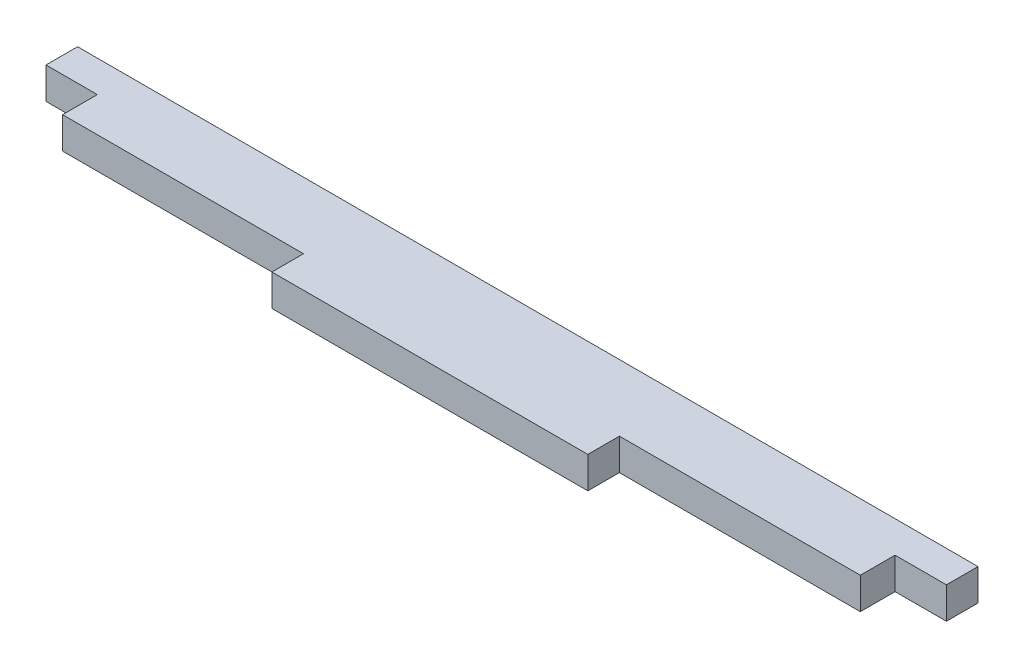
ISO-10303-21;
HEADER;
FILE_DESCRIPTION(('STEP AP214'),'2;1');
FILE_NAME('part.step','',(''),(''),'','','');
FILE_SCHEMA(('AUTOMOTIVE_DESIGN { 1 0 10303 214 1 1 1 1 }'));
ENDSEC;
DATA;
#1=APPLICATION_CONTEXT('core data for automotive mechanical design processes');
#2=APPLICATION_PROTOCOL_DEFINITION('international standard','automotive_design',2000,#1);
#3=PRODUCT_CONTEXT('',#1,'mechanical');
#4=PRODUCT('Part','Part','',(#3));
#5=PRODUCT_RELATED_PRODUCT_CATEGORY('part','',(#4));
#6=PRODUCT_DEFINITION_FORMATION('','',#4);
#7=PRODUCT_DEFINITION_CONTEXT('part definition',#1,'design');
#8=PRODUCT_DEFINITION('design','',#6,#7);
#9=PRODUCT_DEFINITION_SHAPE('','',#8);
#10=(LENGTH_UNIT() NAMED_UNIT(*) SI_UNIT(.MILLI.,.METRE.));
#11=(NAMED_UNIT(*) PLANE_ANGLE_UNIT() SI_UNIT($,.RADIAN.));
#12=(NAMED_UNIT(*) SI_UNIT($,.STERADIAN.) SOLID_ANGLE_UNIT());
#13=UNCERTAINTY_MEASURE_WITH_UNIT(LENGTH_MEASURE(1.E-05),#10,'distance_accuracy_value','');
#14=(GEOMETRIC_REPRESENTATION_CONTEXT(3) GLOBAL_UNCERTAINTY_ASSIGNED_CONTEXT((#13)) GLOBAL_UNIT_ASSIGNED_CONTEXT((#10,
#11,#12)) REPRESENTATION_CONTEXT('',''));
#15=CARTESIAN_POINT('',(0.,0.,0.));
#16=DIRECTION('',(0.,0.,1.));
#17=DIRECTION('',(1.,0.,0.));
#18=AXIS2_PLACEMENT_3D('',#15,#16,#17);
#19=CARTESIAN_POINT('',(-25.25,2.,-4.2));
#20=DIRECTION('',(1.,0.,0.));
#21=DIRECTION('',(0.,0.,-1.));
#22=AXIS2_PLACEMENT_3D('',#19,#20,#21);
#23=PLANE('',#22);
#24=DIRECTION('',(0.,0.,1.));
#25=VECTOR('',#24,1.);
#26=CARTESIAN_POINT('',(-25.25,0.,-4.2));
#27=LINE('',#26,#25);
#28=CARTESIAN_POINT('',(-25.25,0.,-4.2));
#29=VERTEX_POINT('',#28);
#30=CARTESIAN_POINT('',(-25.25,0.,-2.));
#31=VERTEX_POINT('',#30);
#32=EDGE_CURVE('E154',#29,#31,#27,.T.);
#33=ORIENTED_EDGE('',*,*,#32,.T.);
#34=DIRECTION('',(0.,-1.,0.));
#35=VECTOR('',#34,1.);
#36=CARTESIAN_POINT('',(-25.25,2.,-2.));
#37=LINE('',#36,#35);
#38=CARTESIAN_POINT('',(-25.25,2.,-2.));
#39=VERTEX_POINT('',#38);
#40=EDGE_CURVE('E11',#39,#31,#37,.T.);
#41=ORIENTED_EDGE('',*,*,#40,.F.);
#42=DIRECTION('',(0.,0.,1.));
#43=VECTOR('',#42,1.);
#44=CARTESIAN_POINT('',(-25.25,2.,-4.2));
#45=LINE('',#44,#43);
#46=CARTESIAN_POINT('',(-25.25,2.,-4.2));
#47=VERTEX_POINT('',#46);
#48=EDGE_CURVE('E176',#47,#39,#45,.T.);
#49=ORIENTED_EDGE('',*,*,#48,.F.);
#50=DIRECTION('',(0.,-1.,0.));
#51=VECTOR('',#50,1.);
#52=CARTESIAN_POINT('',(-25.25,2.,-4.2));
#53=LINE('',#52,#51);
#54=EDGE_CURVE('E150',#47,#29,#53,.T.);
#55=ORIENTED_EDGE('',*,*,#54,.T.);
#56=EDGE_LOOP('',(#33,#41,#49,#55));
#57=FACE_BOUND('',#56,.T.);
#58=ADVANCED_FACE('F34',(#57),#23,.F.);
#59=CARTESIAN_POINT('',(-25.25,2.,-2.));
#60=DIRECTION('',(0.,0.,-1.));
#61=DIRECTION('',(-1.,0.,0.));
#62=AXIS2_PLACEMENT_3D('',#59,#60,#61);
#63=PLANE('',#62);
#64=DIRECTION('',(1.,0.,0.));
#65=VECTOR('',#64,1.);
#66=CARTESIAN_POINT('',(-25.25,0.,-2.));
#67=LINE('',#66,#65);
#68=CARTESIAN_POINT('',(-10.,0.,-2.));
#69=VERTEX_POINT('',#68);
#70=EDGE_CURVE('E157',#31,#69,#67,.T.);
#71=ORIENTED_EDGE('',*,*,#70,.T.);
#72=DIRECTION('',(0.,-1.,0.));
#73=VECTOR('',#72,1.);
#74=CARTESIAN_POINT('',(-10.,2.,-2.));
#75=LINE('',#74,#73);
#76=CARTESIAN_POINT('',(-10.,2.,-2.));
#77=VERTEX_POINT('',#76);
#78=EDGE_CURVE('E42',#77,#69,#75,.T.);
#79=ORIENTED_EDGE('',*,*,#78,.F.);
#80=DIRECTION('',(1.,0.,0.));
#81=VECTOR('',#80,1.);
#82=CARTESIAN_POINT('',(-25.25,2.,-2.));
#83=LINE('',#82,#81);
#84=EDGE_CURVE('E105',#39,#77,#83,.T.);
#85=ORIENTED_EDGE('',*,*,#84,.F.);
#86=ORIENTED_EDGE('',*,*,#40,.T.);
#87=EDGE_LOOP('',(#71,#79,#85,#86));
#88=FACE_BOUND('',#87,.T.);
#89=ADVANCED_FACE('F254',(#88),#63,.F.);
#90=CARTESIAN_POINT('',(-10.,2.,-2.));
#91=DIRECTION('',(1.,0.,0.));
#92=DIRECTION('',(0.,0.,-1.));
#93=AXIS2_PLACEMENT_3D('',#90,#91,#92);
#94=PLANE('',#93);
#95=DIRECTION('',(0.,0.,1.));
#96=VECTOR('',#95,1.);
#97=CARTESIAN_POINT('',(-10.,0.,-2.));
#98=LINE('',#97,#96);
#99=CARTESIAN_POINT('',(-10.,0.,0.));
#100=VERTEX_POINT('',#99);
#101=EDGE_CURVE('E159',#69,#100,#98,.T.);
#102=ORIENTED_EDGE('',*,*,#101,.T.);
#103=DIRECTION('',(0.,-1.,0.));
#104=VECTOR('',#103,1.);
#105=CARTESIAN_POINT('',(-10.,2.,0.));
#106=LINE('',#105,#104);
#107=CARTESIAN_POINT('',(-10.,2.,0.));
#108=VERTEX_POINT('',#107);
#109=EDGE_CURVE('E195',#108,#100,#106,.T.);
#110=ORIENTED_EDGE('',*,*,#109,.F.);
#111=DIRECTION('',(0.,0.,1.));
#112=VECTOR('',#111,1.);
#113=CARTESIAN_POINT('',(-10.,2.,-2.));
#114=LINE('',#113,#112);
#115=EDGE_CURVE('E203',#77,#108,#114,.T.);
#116=ORIENTED_EDGE('',*,*,#115,.F.);
#117=ORIENTED_EDGE('',*,*,#78,.T.);
#118=EDGE_LOOP('',(#102,#110,#116,#117));
#119=FACE_BOUND('',#118,.T.);
#120=ADVANCED_FACE('F201',(#119),#94,.F.);
#121=CARTESIAN_POINT('',(-10.,2.,0.));
#122=DIRECTION('',(0.,0.,-1.));
#123=DIRECTION('',(-1.,0.,0.));
#124=AXIS2_PLACEMENT_3D('',#121,#122,#123);
#125=PLANE('',#124);
#126=DIRECTION('',(1.,0.,0.));
#127=VECTOR('',#126,1.);
#128=CARTESIAN_POINT('',(-10.,0.,0.));
#129=LINE('',#128,#127);
#130=CARTESIAN_POINT('',(10.,0.,0.));
#131=VERTEX_POINT('',#130);
#132=EDGE_CURVE('E161',#100,#131,#129,.T.);
#133=ORIENTED_EDGE('',*,*,#132,.T.);
#134=DIRECTION('',(0.,-1.,0.));
#135=VECTOR('',#134,1.);
#136=CARTESIAN_POINT('',(10.,2.,0.));
#137=LINE('',#136,#135);
#138=CARTESIAN_POINT('',(10.,2.,0.));
#139=VERTEX_POINT('',#138);
#140=EDGE_CURVE('E192',#139,#131,#137,.T.);
#141=ORIENTED_EDGE('',*,*,#140,.F.);
#142=DIRECTION('',(1.,0.,0.));
#143=VECTOR('',#142,1.);
#144=CARTESIAN_POINT('',(-10.,2.,0.));
#145=LINE('',#144,#143);
#146=EDGE_CURVE('E221',#108,#139,#145,.T.);
#147=ORIENTED_EDGE('',*,*,#146,.F.);
#148=ORIENTED_EDGE('',*,*,#109,.T.);
#149=EDGE_LOOP('',(#133,#141,#147,#148));
#150=FACE_BOUND('',#149,.T.);
#151=ADVANCED_FACE('F212',(#150),#125,.F.);
#152=CARTESIAN_POINT('',(10.,2.,0.));
#153=DIRECTION('',(-1.,0.,0.));
#154=DIRECTION('',(0.,0.,1.));
#155=AXIS2_PLACEMENT_3D('',#152,#153,#154);
#156=PLANE('',#155);
#157=DIRECTION('',(0.,0.,-1.));
#158=VECTOR('',#157,1.);
#159=CARTESIAN_POINT('',(10.,0.,0.));
#160=LINE('',#159,#158);
#161=CARTESIAN_POINT('',(10.,0.,-2.));
#162=VERTEX_POINT('',#161);
#163=EDGE_CURVE('E163',#131,#162,#160,.T.);
#164=ORIENTED_EDGE('',*,*,#163,.T.);
#165=DIRECTION('',(0.,-1.,0.));
#166=VECTOR('',#165,1.);
#167=CARTESIAN_POINT('',(10.,2.,-2.));
#168=LINE('',#167,#166);
#169=CARTESIAN_POINT('',(10.,2.,-2.));
#170=VERTEX_POINT('',#169);
#171=EDGE_CURVE('E189',#170,#162,#168,.T.);
#172=ORIENTED_EDGE('',*,*,#171,.F.);
#173=DIRECTION('',(0.,0.,-1.));
#174=VECTOR('',#173,1.);
#175=CARTESIAN_POINT('',(10.,2.,0.));
#176=LINE('',#175,#174);
#177=EDGE_CURVE('E218',#139,#170,#176,.T.);
#178=ORIENTED_EDGE('',*,*,#177,.F.);
#179=ORIENTED_EDGE('',*,*,#140,.T.);
#180=EDGE_LOOP('',(#164,#172,#178,#179));
#181=FACE_BOUND('',#180,.T.);
#182=ADVANCED_FACE('F216',(#181),#156,.F.);
#183=CARTESIAN_POINT('',(10.,2.,-2.));
#184=DIRECTION('',(0.,0.,-1.));
#185=DIRECTION('',(-1.,0.,0.));
#186=AXIS2_PLACEMENT_3D('',#183,#184,#185);
#187=PLANE('',#186);
#188=DIRECTION('',(1.,0.,0.));
#189=VECTOR('',#188,1.);
#190=CARTESIAN_POINT('',(10.,0.,-2.));
#191=LINE('',#190,#189);
#192=CARTESIAN_POINT('',(25.25,0.,-2.));
#193=VERTEX_POINT('',#192);
#194=EDGE_CURVE('E165',#162,#193,#191,.T.);
#195=ORIENTED_EDGE('',*,*,#194,.T.);
#196=DIRECTION('',(0.,-1.,0.));
#197=VECTOR('',#196,1.);
#198=CARTESIAN_POINT('',(25.25,2.,-2.));
#199=LINE('',#198,#197);
#200=CARTESIAN_POINT('',(25.25,2.,-2.));
#201=VERTEX_POINT('',#200);
#202=EDGE_CURVE('E186',#201,#193,#199,.T.);
#203=ORIENTED_EDGE('',*,*,#202,.F.);
#204=DIRECTION('',(1.,0.,0.));
#205=VECTOR('',#204,1.);
#206=CARTESIAN_POINT('',(10.,2.,-2.));
#207=LINE('',#206,#205);
#208=EDGE_CURVE('E220',#170,#201,#207,.T.);
#209=ORIENTED_EDGE('',*,*,#208,.F.);
#210=ORIENTED_EDGE('',*,*,#171,.T.);
#211=EDGE_LOOP('',(#195,#203,#209,#210));
#212=FACE_BOUND('',#211,.T.);
#213=ADVANCED_FACE('F267',(#212),#187,.F.);
#214=CARTESIAN_POINT('',(25.25,2.,-2.));
#215=DIRECTION('',(-1.,0.,0.));
#216=DIRECTION('',(0.,0.,1.));
#217=AXIS2_PLACEMENT_3D('',#214,#215,#216);
#218=PLANE('',#217);
#219=DIRECTION('',(0.,0.,-1.));
#220=VECTOR('',#219,1.);
#221=CARTESIAN_POINT('',(25.25,0.,-2.));
#222=LINE('',#221,#220);
#223=CARTESIAN_POINT('',(25.25,0.,-4.2));
#224=VERTEX_POINT('',#223);
#225=EDGE_CURVE('E167',#193,#224,#222,.T.);
#226=ORIENTED_EDGE('',*,*,#225,.T.);
#227=DIRECTION('',(0.,-1.,0.));
#228=VECTOR('',#227,1.);
#229=CARTESIAN_POINT('',(25.25,2.,-4.2));
#230=LINE('',#229,#228);
#231=CARTESIAN_POINT('',(25.25,2.,-4.2));
#232=VERTEX_POINT('',#231);
#233=EDGE_CURVE('E183',#232,#224,#230,.T.);
#234=ORIENTED_EDGE('',*,*,#233,.F.);
#235=DIRECTION('',(0.,0.,-1.));
#236=VECTOR('',#235,1.);
#237=CARTESIAN_POINT('',(25.25,2.,-2.));
#238=LINE('',#237,#236);
#239=EDGE_CURVE('E223',#201,#232,#238,.T.);
#240=ORIENTED_EDGE('',*,*,#239,.F.);
#241=ORIENTED_EDGE('',*,*,#202,.T.);
#242=EDGE_LOOP('',(#226,#234,#240,#241));
#243=FACE_BOUND('',#242,.T.);
#244=ADVANCED_FACE('F270',(#243),#218,.F.);
#245=CARTESIAN_POINT('',(25.25,2.,-4.2));
#246=DIRECTION('',(0.,0.,-1.));
#247=DIRECTION('',(-1.,0.,0.));
#248=AXIS2_PLACEMENT_3D('',#245,#246,#247);
#249=PLANE('',#248);
#250=DIRECTION('',(1.,0.,0.));
#251=VECTOR('',#250,1.);
#252=CARTESIAN_POINT('',(25.25,0.,-4.2));
#253=LINE('',#252,#251);
#254=CARTESIAN_POINT('',(28.5,0.,-4.2));
#255=VERTEX_POINT('',#254);
#256=EDGE_CURVE('E169',#224,#255,#253,.T.);
#257=ORIENTED_EDGE('',*,*,#256,.T.);
#258=DIRECTION('',(0.,-1.,0.));
#259=VECTOR('',#258,1.);
#260=CARTESIAN_POINT('',(28.5,2.,-4.2));
#261=LINE('',#260,#259);
#262=CARTESIAN_POINT('',(28.5,2.,-4.2));
#263=VERTEX_POINT('',#262);
#264=EDGE_CURVE('E180',#263,#255,#261,.T.);
#265=ORIENTED_EDGE('',*,*,#264,.F.);
#266=DIRECTION('',(1.,0.,0.));
#267=VECTOR('',#266,1.);
#268=CARTESIAN_POINT('',(25.25,2.,-4.2));
#269=LINE('',#268,#267);
#270=EDGE_CURVE('E229',#232,#263,#269,.T.);
#271=ORIENTED_EDGE('',*,*,#270,.F.);
#272=ORIENTED_EDGE('',*,*,#233,.T.);
#273=EDGE_LOOP('',(#257,#265,#271,#272));
#274=FACE_BOUND('',#273,.T.);
#275=ADVANCED_FACE('F235',(#274),#249,.F.);
#276=CARTESIAN_POINT('',(28.5,2.,-4.2));
#277=DIRECTION('',(-1.,0.,0.));
#278=DIRECTION('',(0.,0.,1.));
#279=AXIS2_PLACEMENT_3D('',#276,#277,#278);
#280=PLANE('',#279);
#281=DIRECTION('',(0.,0.,-1.));
#282=VECTOR('',#281,1.);
#283=CARTESIAN_POINT('',(28.5,0.,-4.2));
#284=LINE('',#283,#282);
#285=CARTESIAN_POINT('',(28.5,0.,-6.2));
#286=VERTEX_POINT('',#285);
#287=EDGE_CURVE('E171',#255,#286,#284,.T.);
#288=ORIENTED_EDGE('',*,*,#287,.T.);
#289=DIRECTION('',(0.,-1.,0.));
#290=VECTOR('',#289,1.);
#291=CARTESIAN_POINT('',(28.5,2.,-6.2));
#292=LINE('',#291,#290);
#293=CARTESIAN_POINT('',(28.5,2.,-6.2));
#294=VERTEX_POINT('',#293);
#295=EDGE_CURVE('E145',#294,#286,#292,.T.);
#296=ORIENTED_EDGE('',*,*,#295,.F.);
#297=DIRECTION('',(0.,0.,-1.));
#298=VECTOR('',#297,1.);
#299=CARTESIAN_POINT('',(28.5,2.,-4.2));
#300=LINE('',#299,#298);
#301=EDGE_CURVE('E136',#263,#294,#300,.T.);
#302=ORIENTED_EDGE('',*,*,#301,.F.);
#303=ORIENTED_EDGE('',*,*,#264,.T.);
#304=EDGE_LOOP('',(#288,#296,#302,#303));
#305=FACE_BOUND('',#304,.T.);
#306=ADVANCED_FACE('F239',(#305),#280,.F.);
#307=CARTESIAN_POINT('',(28.5,2.,-6.2));
#308=DIRECTION('',(0.,0.,1.));
#309=DIRECTION('',(1.,0.,0.));
#310=AXIS2_PLACEMENT_3D('',#307,#308,#309);
#311=PLANE('',#310);
#312=DIRECTION('',(-1.,0.,0.));
#313=VECTOR('',#312,1.);
#314=CARTESIAN_POINT('',(28.5,0.,-6.2));
#315=LINE('',#314,#313);
#316=CARTESIAN_POINT('',(-28.5,0.,-6.19999999999999));
#317=VERTEX_POINT('',#316);
#318=EDGE_CURVE('E144',#286,#317,#315,.T.);
#319=ORIENTED_EDGE('',*,*,#318,.T.);
#320=DIRECTION('',(0.,-1.,0.));
#321=VECTOR('',#320,1.);
#322=CARTESIAN_POINT('',(-28.5,2.,-6.19999999999999));
#323=LINE('',#322,#321);
#324=CARTESIAN_POINT('',(-28.5,2.,-6.19999999999999));
#325=VERTEX_POINT('',#324);
#326=EDGE_CURVE('E141',#325,#317,#323,.T.);
#327=ORIENTED_EDGE('',*,*,#326,.F.);
#328=DIRECTION('',(-1.,0.,0.));
#329=VECTOR('',#328,1.);
#330=CARTESIAN_POINT('',(28.5,2.,-6.2));
#331=LINE('',#330,#329);
#332=EDGE_CURVE('E130',#294,#325,#331,.T.);
#333=ORIENTED_EDGE('',*,*,#332,.F.);
#334=ORIENTED_EDGE('',*,*,#295,.T.);
#335=EDGE_LOOP('',(#319,#327,#333,#334));
#336=FACE_BOUND('',#335,.T.);
#337=ADVANCED_FACE('F142',(#336),#311,.F.);
#338=CARTESIAN_POINT('',(-28.5,2.,-6.19999999999999));
#339=DIRECTION('',(1.,0.,0.));
#340=DIRECTION('',(0.,0.,-1.));
#341=AXIS2_PLACEMENT_3D('',#338,#339,#340);
#342=PLANE('',#341);
#343=DIRECTION('',(0.,0.,1.));
#344=VECTOR('',#343,1.);
#345=CARTESIAN_POINT('',(-28.5,0.,-6.19999999999999));
#346=LINE('',#345,#344);
#347=CARTESIAN_POINT('',(-28.5,0.,-4.2));
#348=VERTEX_POINT('',#347);
#349=EDGE_CURVE('E91',#317,#348,#346,.T.);
#350=ORIENTED_EDGE('',*,*,#349,.T.);
#351=DIRECTION('',(0.,-1.,0.));
#352=VECTOR('',#351,1.);
#353=CARTESIAN_POINT('',(-28.5,2.,-4.2));
#354=LINE('',#353,#352);
#355=CARTESIAN_POINT('',(-28.5,2.,-4.2));
#356=VERTEX_POINT('',#355);
#357=EDGE_CURVE('E146',#356,#348,#354,.T.);
#358=ORIENTED_EDGE('',*,*,#357,.F.);
#359=DIRECTION('',(0.,0.,1.));
#360=VECTOR('',#359,1.);
#361=CARTESIAN_POINT('',(-28.5,2.,-6.19999999999999));
#362=LINE('',#361,#360);
#363=EDGE_CURVE('E134',#325,#356,#362,.T.);
#364=ORIENTED_EDGE('',*,*,#363,.F.);
#365=ORIENTED_EDGE('',*,*,#326,.T.);
#366=EDGE_LOOP('',(#350,#358,#364,#365));
#367=FACE_BOUND('',#366,.T.);
#368=ADVANCED_FACE('F148',(#367),#342,.F.);
#369=CARTESIAN_POINT('',(-28.5,2.,-4.2));
#370=DIRECTION('',(0.,0.,-1.));
#371=DIRECTION('',(-1.,0.,0.));
#372=AXIS2_PLACEMENT_3D('',#369,#370,#371);
#373=PLANE('',#372);
#374=DIRECTION('',(1.,0.,0.));
#375=VECTOR('',#374,1.);
#376=CARTESIAN_POINT('',(-28.5,0.,-4.2));
#377=LINE('',#376,#375);
#378=EDGE_CURVE('E97',#348,#29,#377,.T.);
#379=ORIENTED_EDGE('',*,*,#378,.T.);
#380=ORIENTED_EDGE('',*,*,#54,.F.);
#381=DIRECTION('',(1.,0.,0.));
#382=VECTOR('',#381,1.);
#383=CARTESIAN_POINT('',(-28.5,2.,-4.2));
#384=LINE('',#383,#382);
#385=EDGE_CURVE('E50',#356,#47,#384,.T.);
#386=ORIENTED_EDGE('',*,*,#385,.F.);
#387=ORIENTED_EDGE('',*,*,#357,.T.);
#388=EDGE_LOOP('',(#379,#380,#386,#387));
#389=FACE_BOUND('',#388,.T.);
#390=ADVANCED_FACE('F243',(#389),#373,.F.);
#391=CARTESIAN_POINT('',(0.,2.,0.));
#392=DIRECTION('',(0.,1.,0.));
#393=DIRECTION('',(0.,0.,1.));
#394=AXIS2_PLACEMENT_3D('',#391,#392,#393);
#395=PLANE('',#394);
#396=ORIENTED_EDGE('',*,*,#48,.T.);
#397=ORIENTED_EDGE('',*,*,#84,.T.);
#398=ORIENTED_EDGE('',*,*,#115,.T.);
#399=ORIENTED_EDGE('',*,*,#146,.T.);
#400=ORIENTED_EDGE('',*,*,#177,.T.);
#401=ORIENTED_EDGE('',*,*,#208,.T.);
#402=ORIENTED_EDGE('',*,*,#239,.T.);
#403=ORIENTED_EDGE('',*,*,#270,.T.);
#404=ORIENTED_EDGE('',*,*,#301,.T.);
#405=ORIENTED_EDGE('',*,*,#332,.T.);
#406=ORIENTED_EDGE('',*,*,#363,.T.);
#407=ORIENTED_EDGE('',*,*,#385,.T.);
#408=EDGE_LOOP('',(#396,#397,#398,#399,#400,#401,#402,#403,#404,#405,#406,#407));
#409=FACE_BOUND('',#408,.T.);
#410=ADVANCED_FACE('F132',(#409),#395,.T.);
#411=CARTESIAN_POINT('',(0.,0.,0.));
#412=DIRECTION('',(0.,1.,0.));
#413=DIRECTION('',(0.,0.,1.));
#414=AXIS2_PLACEMENT_3D('',#411,#412,#413);
#415=PLANE('',#414);
#416=ORIENTED_EDGE('',*,*,#32,.F.);
#417=ORIENTED_EDGE('',*,*,#378,.F.);
#418=ORIENTED_EDGE('',*,*,#349,.F.);
#419=ORIENTED_EDGE('',*,*,#318,.F.);
#420=ORIENTED_EDGE('',*,*,#287,.F.);
#421=ORIENTED_EDGE('',*,*,#256,.F.);
#422=ORIENTED_EDGE('',*,*,#225,.F.);
#423=ORIENTED_EDGE('',*,*,#194,.F.);
#424=ORIENTED_EDGE('',*,*,#163,.F.);
#425=ORIENTED_EDGE('',*,*,#132,.F.);
#426=ORIENTED_EDGE('',*,*,#101,.F.);
#427=ORIENTED_EDGE('',*,*,#70,.F.);
#428=EDGE_LOOP('',(#416,#417,#418,#419,#420,#421,#422,#423,#424,#425,#426,#427));
#429=FACE_BOUND('',#428,.T.);
#430=ADVANCED_FACE('F207',(#429),#415,.F.);
#431=CLOSED_SHELL('',(#58,#89,#120,#151,#182,#213,#244,#275,#306,#337,#368,#390,#410,#430));
#432=MANIFOLD_SOLID_BREP('B2',#431);
#433=ADVANCED_BREP_SHAPE_REPRESENTATION('',(#18,#432),#14);
#434=SHAPE_DEFINITION_REPRESENTATION(#9,#433);
ENDSEC;
END-ISO-10303-21;
